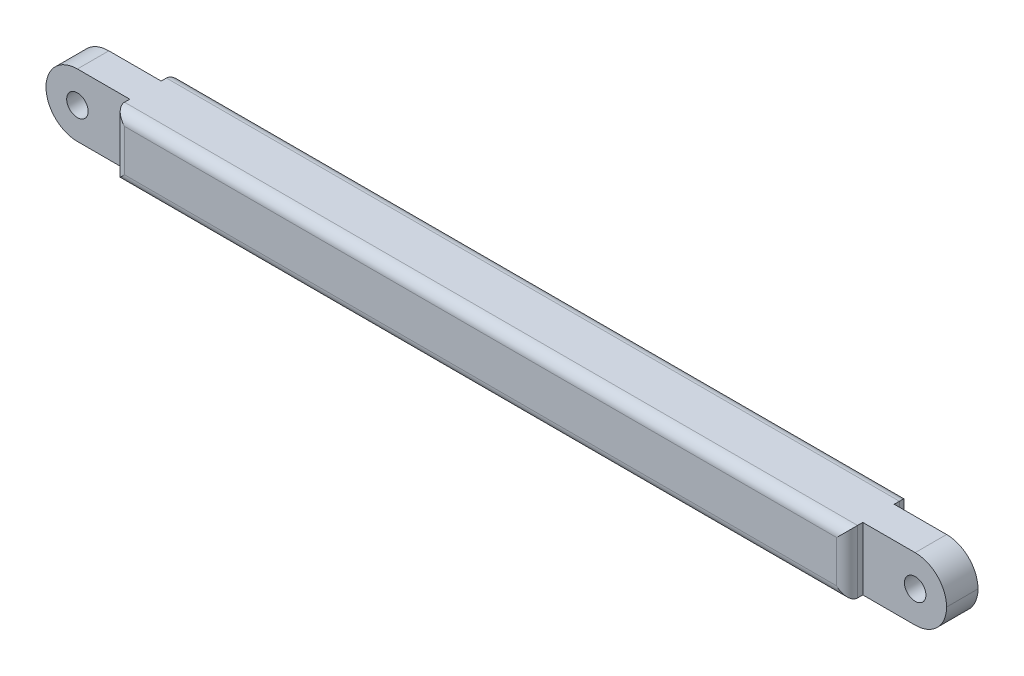
ISO-10303-21;
HEADER;
FILE_DESCRIPTION(('STEP AP214'),'2;1');
FILE_NAME('part.step','',(''),(''),'','','');
FILE_SCHEMA(('AUTOMOTIVE_DESIGN { 1 0 10303 214 1 1 1 1 }'));
ENDSEC;
DATA;
#1=APPLICATION_CONTEXT('core data for automotive mechanical design processes');
#2=APPLICATION_PROTOCOL_DEFINITION('international standard','automotive_design',2000,#1);
#3=PRODUCT_CONTEXT('',#1,'mechanical');
#4=PRODUCT('Part','Part','',(#3));
#5=PRODUCT_RELATED_PRODUCT_CATEGORY('part','',(#4));
#6=PRODUCT_DEFINITION_FORMATION('','',#4);
#7=PRODUCT_DEFINITION_CONTEXT('part definition',#1,'design');
#8=PRODUCT_DEFINITION('design','',#6,#7);
#9=PRODUCT_DEFINITION_SHAPE('','',#8);
#10=(LENGTH_UNIT() NAMED_UNIT(*) SI_UNIT(.MILLI.,.METRE.));
#11=(NAMED_UNIT(*) PLANE_ANGLE_UNIT() SI_UNIT($,.RADIAN.));
#12=(NAMED_UNIT(*) SI_UNIT($,.STERADIAN.) SOLID_ANGLE_UNIT());
#13=UNCERTAINTY_MEASURE_WITH_UNIT(LENGTH_MEASURE(1.E-05),#10,'distance_accuracy_value','');
#14=(GEOMETRIC_REPRESENTATION_CONTEXT(3) GLOBAL_UNCERTAINTY_ASSIGNED_CONTEXT((#13)) GLOBAL_UNIT_ASSIGNED_CONTEXT((#10,
#11,#12)) REPRESENTATION_CONTEXT('',''));
#15=CARTESIAN_POINT('',(0.,0.,0.));
#16=DIRECTION('',(0.,0.,1.));
#17=DIRECTION('',(1.,0.,0.));
#18=AXIS2_PLACEMENT_3D('',#15,#16,#17);
#19=CARTESIAN_POINT('',(70.,6.,0.));
#20=DIRECTION('',(-1.,0.,0.));
#21=DIRECTION('',(0.,0.,1.));
#22=AXIS2_PLACEMENT_3D('',#19,#20,#21);
#23=PLANE('',#22);
#24=DIRECTION('',(0.,0.,-1.));
#25=VECTOR('',#24,1.);
#26=CARTESIAN_POINT('',(70.,6.,0.));
#27=LINE('',#26,#25);
#28=CARTESIAN_POINT('',(70.,6.,-1.));
#29=VERTEX_POINT('',#28);
#30=CARTESIAN_POINT('',(70.,6.,-1.5));
#31=VERTEX_POINT('',#30);
#32=EDGE_CURVE('E194',#29,#31,#27,.T.);
#33=ORIENTED_EDGE('',*,*,#32,.F.);
#34=DIRECTION('',(0.,-1.,0.));
#35=VECTOR('',#34,1.);
#36=CARTESIAN_POINT('',(70.,6.,-1.));
#37=LINE('',#36,#35);
#38=CARTESIAN_POINT('',(70.,0.,-1.));
#39=VERTEX_POINT('',#38);
#40=EDGE_CURVE('E291',#29,#39,#37,.T.);
#41=ORIENTED_EDGE('',*,*,#40,.T.);
#42=DIRECTION('',(0.,0.,-1.));
#43=VECTOR('',#42,1.);
#44=CARTESIAN_POINT('',(70.,0.,0.));
#45=LINE('',#44,#43);
#46=CARTESIAN_POINT('',(70.,0.,-1.5));
#47=VERTEX_POINT('',#46);
#48=EDGE_CURVE('E248',#39,#47,#45,.T.);
#49=ORIENTED_EDGE('',*,*,#48,.T.);
#50=DIRECTION('',(0.,-1.,0.));
#51=VECTOR('',#50,1.);
#52=CARTESIAN_POINT('',(70.,6.,-1.5));
#53=LINE('',#52,#51);
#54=EDGE_CURVE('E200',#31,#47,#53,.T.);
#55=ORIENTED_EDGE('',*,*,#54,.F.);
#56=EDGE_LOOP('',(#33,#41,#49,#55));
#57=FACE_BOUND('',#56,.T.);
#58=ADVANCED_FACE('F45',(#57),#23,.F.);
#59=CARTESIAN_POINT('',(70.,0.,-4.5));
#60=VERTEX_POINT('',#59);
#61=CARTESIAN_POINT('',(70.,0.,-5.));
#62=VERTEX_POINT('',#61);
#63=EDGE_CURVE('E247',#60,#62,#45,.T.);
#64=ORIENTED_EDGE('',*,*,#63,.T.);
#65=DIRECTION('',(0.,-1.,0.));
#66=VECTOR('',#65,1.);
#67=CARTESIAN_POINT('',(70.,6.,-5.));
#68=LINE('',#67,#66);
#69=CARTESIAN_POINT('',(70.,6.,-5.));
#70=VERTEX_POINT('',#69);
#71=EDGE_CURVE('E192',#62,#70,#68,.F.);
#72=ORIENTED_EDGE('',*,*,#71,.T.);
#73=CARTESIAN_POINT('',(70.,6.,-4.5));
#74=VERTEX_POINT('',#73);
#75=EDGE_CURVE('E175',#74,#70,#27,.T.);
#76=ORIENTED_EDGE('',*,*,#75,.F.);
#77=DIRECTION('',(0.,1.,0.));
#78=VECTOR('',#77,1.);
#79=CARTESIAN_POINT('',(70.,6.,-4.5));
#80=LINE('',#79,#78);
#81=EDGE_CURVE('E189',#60,#74,#80,.T.);
#82=ORIENTED_EDGE('',*,*,#81,.F.);
#83=EDGE_LOOP('',(#64,#72,#76,#82));
#84=FACE_BOUND('',#83,.T.);
#85=ADVANCED_FACE('F188',(#84),#23,.F.);
#86=CARTESIAN_POINT('',(0.,6.,0.));
#87=DIRECTION('',(1.,0.,0.));
#88=DIRECTION('',(0.,0.,-1.));
#89=AXIS2_PLACEMENT_3D('',#86,#87,#88);
#90=PLANE('',#89);
#91=DIRECTION('',(0.,0.,1.));
#92=VECTOR('',#91,1.);
#93=CARTESIAN_POINT('',(0.,6.,0.));
#94=LINE('',#93,#92);
#95=CARTESIAN_POINT('',(0.,6.,-5.));
#96=VERTEX_POINT('',#95);
#97=CARTESIAN_POINT('',(0.,6.,-4.5));
#98=VERTEX_POINT('',#97);
#99=EDGE_CURVE('E195',#96,#98,#94,.T.);
#100=ORIENTED_EDGE('',*,*,#99,.F.);
#101=DIRECTION('',(0.,-1.,0.));
#102=VECTOR('',#101,1.);
#103=CARTESIAN_POINT('',(0.,6.,-5.));
#104=LINE('',#103,#102);
#105=CARTESIAN_POINT('',(0.,0.,-5.));
#106=VERTEX_POINT('',#105);
#107=EDGE_CURVE('E274',#96,#106,#104,.T.);
#108=ORIENTED_EDGE('',*,*,#107,.T.);
#109=DIRECTION('',(0.,0.,1.));
#110=VECTOR('',#109,1.);
#111=CARTESIAN_POINT('',(0.,0.,0.));
#112=LINE('',#111,#110);
#113=CARTESIAN_POINT('',(0.,0.,-4.5));
#114=VERTEX_POINT('',#113);
#115=EDGE_CURVE('E243',#106,#114,#112,.T.);
#116=ORIENTED_EDGE('',*,*,#115,.T.);
#117=DIRECTION('',(0.,-1.,0.));
#118=VECTOR('',#117,1.);
#119=CARTESIAN_POINT('',(0.,6.,-4.5));
#120=LINE('',#119,#118);
#121=EDGE_CURVE('E215',#98,#114,#120,.T.);
#122=ORIENTED_EDGE('',*,*,#121,.F.);
#123=EDGE_LOOP('',(#100,#108,#116,#122));
#124=FACE_BOUND('',#123,.T.);
#125=ADVANCED_FACE('F440',(#124),#90,.F.);
#126=CARTESIAN_POINT('',(0.,0.,-1.5));
#127=VERTEX_POINT('',#126);
#128=CARTESIAN_POINT('',(0.,0.,-1.));
#129=VERTEX_POINT('',#128);
#130=EDGE_CURVE('E235',#127,#129,#112,.T.);
#131=ORIENTED_EDGE('',*,*,#130,.T.);
#132=DIRECTION('',(0.,-1.,0.));
#133=VECTOR('',#132,1.);
#134=CARTESIAN_POINT('',(0.,6.,-1.));
#135=LINE('',#134,#133);
#136=CARTESIAN_POINT('',(0.,6.,-1.));
#137=VERTEX_POINT('',#136);
#138=EDGE_CURVE('E270',#129,#137,#135,.F.);
#139=ORIENTED_EDGE('',*,*,#138,.T.);
#140=CARTESIAN_POINT('',(0.,6.,-1.5));
#141=VERTEX_POINT('',#140);
#142=EDGE_CURVE('E238',#141,#137,#94,.T.);
#143=ORIENTED_EDGE('',*,*,#142,.F.);
#144=DIRECTION('',(0.,1.,0.));
#145=VECTOR('',#144,1.);
#146=CARTESIAN_POINT('',(0.,6.,-1.5));
#147=LINE('',#146,#145);
#148=EDGE_CURVE('E219',#127,#141,#147,.T.);
#149=ORIENTED_EDGE('',*,*,#148,.F.);
#150=EDGE_LOOP('',(#131,#139,#143,#149));
#151=FACE_BOUND('',#150,.T.);
#152=ADVANCED_FACE('F402',(#151),#90,.F.);
#153=CARTESIAN_POINT('',(0.,6.,0.));
#154=DIRECTION('',(0.,0.,-1.));
#155=DIRECTION('',(-1.,0.,0.));
#156=AXIS2_PLACEMENT_3D('',#153,#154,#155);
#157=PLANE('',#156);
#158=DIRECTION('',(0.,-1.,0.));
#159=VECTOR('',#158,1.);
#160=CARTESIAN_POINT('',(1.,6.,0.));
#161=LINE('',#160,#159);
#162=CARTESIAN_POINT('',(1.,5.,0.));
#163=VERTEX_POINT('',#162);
#164=CARTESIAN_POINT('',(1.,1.,0.));
#165=VERTEX_POINT('',#164);
#166=EDGE_CURVE('E263',#163,#165,#161,.T.);
#167=ORIENTED_EDGE('',*,*,#166,.T.);
#168=DIRECTION('',(1.,0.,0.));
#169=VECTOR('',#168,1.);
#170=CARTESIAN_POINT('',(70.,1.,0.));
#171=LINE('',#170,#169);
#172=CARTESIAN_POINT('',(69.,1.,0.));
#173=VERTEX_POINT('',#172);
#174=EDGE_CURVE('E267',#165,#173,#171,.T.);
#175=ORIENTED_EDGE('',*,*,#174,.T.);
#176=DIRECTION('',(0.,-1.,0.));
#177=VECTOR('',#176,1.);
#178=CARTESIAN_POINT('',(69.,6.,0.));
#179=LINE('',#178,#177);
#180=CARTESIAN_POINT('',(69.,5.,0.));
#181=VERTEX_POINT('',#180);
#182=EDGE_CURVE('E260',#173,#181,#179,.F.);
#183=ORIENTED_EDGE('',*,*,#182,.T.);
#184=DIRECTION('',(1.,0.,0.));
#185=VECTOR('',#184,1.);
#186=CARTESIAN_POINT('',(0.,5.,0.));
#187=LINE('',#186,#185);
#188=EDGE_CURVE('E242',#181,#163,#187,.F.);
#189=ORIENTED_EDGE('',*,*,#188,.T.);
#190=EDGE_LOOP('',(#167,#175,#183,#189));
#191=FACE_BOUND('',#190,.T.);
#192=ADVANCED_FACE('F415',(#191),#157,.F.);
#193=CARTESIAN_POINT('',(0.,6.,-6.));
#194=DIRECTION('',(0.,0.,1.));
#195=DIRECTION('',(1.,0.,0.));
#196=AXIS2_PLACEMENT_3D('',#193,#194,#195);
#197=PLANE('',#196);
#198=DIRECTION('',(0.,-1.,0.));
#199=VECTOR('',#198,1.);
#200=CARTESIAN_POINT('',(69.,6.,-6.));
#201=LINE('',#200,#199);
#202=CARTESIAN_POINT('',(69.,5.,-6.));
#203=VERTEX_POINT('',#202);
#204=CARTESIAN_POINT('',(69.,1.,-6.));
#205=VERTEX_POINT('',#204);
#206=EDGE_CURVE('E281',#203,#205,#201,.T.);
#207=ORIENTED_EDGE('',*,*,#206,.T.);
#208=DIRECTION('',(-1.,0.,0.));
#209=VECTOR('',#208,1.);
#210=CARTESIAN_POINT('',(0.,1.,-6.));
#211=LINE('',#210,#209);
#212=CARTESIAN_POINT('',(1.,1.,-6.));
#213=VERTEX_POINT('',#212);
#214=EDGE_CURVE('E288',#205,#213,#211,.T.);
#215=ORIENTED_EDGE('',*,*,#214,.T.);
#216=DIRECTION('',(0.,-1.,0.));
#217=VECTOR('',#216,1.);
#218=CARTESIAN_POINT('',(1.,6.,-6.));
#219=LINE('',#218,#217);
#220=CARTESIAN_POINT('',(1.,5.,-6.));
#221=VERTEX_POINT('',#220);
#222=EDGE_CURVE('E284',#213,#221,#219,.F.);
#223=ORIENTED_EDGE('',*,*,#222,.T.);
#224=DIRECTION('',(-1.,0.,0.));
#225=VECTOR('',#224,1.);
#226=CARTESIAN_POINT('',(0.,5.,-6.));
#227=LINE('',#226,#225);
#228=EDGE_CURVE('E278',#221,#203,#227,.F.);
#229=ORIENTED_EDGE('',*,*,#228,.T.);
#230=EDGE_LOOP('',(#207,#215,#223,#229));
#231=FACE_BOUND('',#230,.T.);
#232=ADVANCED_FACE('F443',(#231),#197,.F.);
#233=CARTESIAN_POINT('',(0.,6.,0.));
#234=DIRECTION('',(0.,-1.,0.));
#235=DIRECTION('',(0.,0.,-1.));
#236=AXIS2_PLACEMENT_3D('',#233,#234,#235);
#237=PLANE('',#236);
#238=DIRECTION('',(1.,0.,0.));
#239=VECTOR('',#238,1.);
#240=CARTESIAN_POINT('',(-8.,6.,-4.5));
#241=LINE('',#240,#239);
#242=CARTESIAN_POINT('',(-5.,6.,-4.5));
#243=VERTEX_POINT('',#242);
#244=EDGE_CURVE('E223',#243,#98,#241,.T.);
#245=ORIENTED_EDGE('',*,*,#244,.F.);
#246=DIRECTION('',(0.,0.,-1.));
#247=VECTOR('',#246,1.);
#248=CARTESIAN_POINT('',(-5.,6.,-1.5));
#249=LINE('',#248,#247);
#250=CARTESIAN_POINT('',(-5.,6.,-1.5));
#251=VERTEX_POINT('',#250);
#252=EDGE_CURVE('E359',#243,#251,#249,.F.);
#253=ORIENTED_EDGE('',*,*,#252,.T.);
#254=DIRECTION('',(1.,0.,0.));
#255=VECTOR('',#254,1.);
#256=CARTESIAN_POINT('',(-8.,6.,-1.5));
#257=LINE('',#256,#255);
#258=EDGE_CURVE('E226',#251,#141,#257,.T.);
#259=ORIENTED_EDGE('',*,*,#258,.T.);
#260=ORIENTED_EDGE('',*,*,#142,.T.);
#261=DIRECTION('',(1.,0.,0.));
#262=VECTOR('',#261,1.);
#263=CARTESIAN_POINT('',(0.,6.,-1.));
#264=LINE('',#263,#262);
#265=EDGE_CURVE('E302',#137,#29,#264,.T.);
#266=ORIENTED_EDGE('',*,*,#265,.T.);
#267=ORIENTED_EDGE('',*,*,#32,.T.);
#268=DIRECTION('',(-1.,0.,0.));
#269=VECTOR('',#268,1.);
#270=CARTESIAN_POINT('',(78.,6.,-1.5));
#271=LINE('',#270,#269);
#272=CARTESIAN_POINT('',(75.,6.,-1.5));
#273=VERTEX_POINT('',#272);
#274=EDGE_CURVE('E183',#273,#31,#271,.T.);
#275=ORIENTED_EDGE('',*,*,#274,.F.);
#276=DIRECTION('',(0.,0.,1.));
#277=VECTOR('',#276,1.);
#278=CARTESIAN_POINT('',(75.,6.,-4.5));
#279=LINE('',#278,#277);
#280=CARTESIAN_POINT('',(75.,6.,-4.5));
#281=VERTEX_POINT('',#280);
#282=EDGE_CURVE('E179',#273,#281,#279,.F.);
#283=ORIENTED_EDGE('',*,*,#282,.T.);
#284=DIRECTION('',(-1.,0.,0.));
#285=VECTOR('',#284,1.);
#286=CARTESIAN_POINT('',(78.,6.,-4.5));
#287=LINE('',#286,#285);
#288=EDGE_CURVE('E171',#281,#74,#287,.T.);
#289=ORIENTED_EDGE('',*,*,#288,.T.);
#290=ORIENTED_EDGE('',*,*,#75,.T.);
#291=DIRECTION('',(-1.,0.,0.));
#292=VECTOR('',#291,1.);
#293=CARTESIAN_POINT('',(0.,6.,-5.));
#294=LINE('',#293,#292);
#295=EDGE_CURVE('E305',#70,#96,#294,.T.);
#296=ORIENTED_EDGE('',*,*,#295,.T.);
#297=ORIENTED_EDGE('',*,*,#99,.T.);
#298=EDGE_LOOP('',(#245,#253,#259,#260,#266,#267,#275,#283,#289,#290,#296,#297));
#299=FACE_BOUND('',#298,.T.);
#300=ADVANCED_FACE('F174',(#299),#237,.F.);
#301=CARTESIAN_POINT('',(0.,0.,0.));
#302=DIRECTION('',(0.,-1.,0.));
#303=DIRECTION('',(0.,0.,-1.));
#304=AXIS2_PLACEMENT_3D('',#301,#302,#303);
#305=PLANE('',#304);
#306=DIRECTION('',(1.,0.,0.));
#307=VECTOR('',#306,1.);
#308=CARTESIAN_POINT('',(-8.,0.,-1.5));
#309=LINE('',#308,#307);
#310=CARTESIAN_POINT('',(-5.,0.,-1.5));
#311=VERTEX_POINT('',#310);
#312=EDGE_CURVE('E229',#311,#127,#309,.T.);
#313=ORIENTED_EDGE('',*,*,#312,.F.);
#314=DIRECTION('',(0.,0.,1.));
#315=VECTOR('',#314,1.);
#316=CARTESIAN_POINT('',(-5.,0.,0.));
#317=LINE('',#316,#315);
#318=CARTESIAN_POINT('',(-5.,0.,-4.5));
#319=VERTEX_POINT('',#318);
#320=EDGE_CURVE('E347',#311,#319,#317,.F.);
#321=ORIENTED_EDGE('',*,*,#320,.T.);
#322=DIRECTION('',(1.,0.,0.));
#323=VECTOR('',#322,1.);
#324=CARTESIAN_POINT('',(-8.,0.,-4.5));
#325=LINE('',#324,#323);
#326=EDGE_CURVE('E232',#319,#114,#325,.T.);
#327=ORIENTED_EDGE('',*,*,#326,.T.);
#328=ORIENTED_EDGE('',*,*,#115,.F.);
#329=DIRECTION('',(-1.,0.,0.));
#330=VECTOR('',#329,1.);
#331=CARTESIAN_POINT('',(70.,0.,-5.));
#332=LINE('',#331,#330);
#333=EDGE_CURVE('E299',#106,#62,#332,.F.);
#334=ORIENTED_EDGE('',*,*,#333,.T.);
#335=ORIENTED_EDGE('',*,*,#63,.F.);
#336=DIRECTION('',(-1.,0.,0.));
#337=VECTOR('',#336,1.);
#338=CARTESIAN_POINT('',(78.,0.,-4.5));
#339=LINE('',#338,#337);
#340=CARTESIAN_POINT('',(75.,0.,-4.5));
#341=VERTEX_POINT('',#340);
#342=EDGE_CURVE('E182',#341,#60,#339,.T.);
#343=ORIENTED_EDGE('',*,*,#342,.F.);
#344=DIRECTION('',(0.,0.,-1.));
#345=VECTOR('',#344,1.);
#346=CARTESIAN_POINT('',(75.,0.,0.));
#347=LINE('',#346,#345);
#348=CARTESIAN_POINT('',(75.,0.,-1.5));
#349=VERTEX_POINT('',#348);
#350=EDGE_CURVE('E343',#341,#349,#347,.F.);
#351=ORIENTED_EDGE('',*,*,#350,.T.);
#352=DIRECTION('',(-1.,0.,0.));
#353=VECTOR('',#352,1.);
#354=CARTESIAN_POINT('',(78.,0.,-1.5));
#355=LINE('',#354,#353);
#356=EDGE_CURVE('E212',#349,#47,#355,.T.);
#357=ORIENTED_EDGE('',*,*,#356,.T.);
#358=ORIENTED_EDGE('',*,*,#48,.F.);
#359=DIRECTION('',(1.,0.,0.));
#360=VECTOR('',#359,1.);
#361=CARTESIAN_POINT('',(0.,0.,-1.));
#362=LINE('',#361,#360);
#363=EDGE_CURVE('E296',#39,#129,#362,.F.);
#364=ORIENTED_EDGE('',*,*,#363,.T.);
#365=ORIENTED_EDGE('',*,*,#130,.F.);
#366=EDGE_LOOP('',(#313,#321,#327,#328,#334,#335,#343,#351,#357,#358,#364,#365));
#367=FACE_BOUND('',#366,.T.);
#368=ADVANCED_FACE('F390',(#367),#305,.T.);
#369=CARTESIAN_POINT('',(-8.,6.,-4.5));
#370=DIRECTION('',(0.,0.,1.));
#371=DIRECTION('',(1.,0.,0.));
#372=AXIS2_PLACEMENT_3D('',#369,#370,#371);
#373=PLANE('',#372);
#374=CARTESIAN_POINT('',(-5.,3.,-4.5));
#375=DIRECTION('',(0.,0.,1.));
#376=DIRECTION('',(1.,0.,0.));
#377=AXIS2_PLACEMENT_3D('',#374,#375,#376);
#378=CIRCLE('',#377,1.025);
#379=CARTESIAN_POINT('',(-3.975,3.,-4.5));
#380=VERTEX_POINT('',#379);
#381=EDGE_CURVE('E206',#380,#380,#378,.T.);
#382=ORIENTED_EDGE('',*,*,#381,.T.);
#383=EDGE_LOOP('',(#382));
#384=FACE_BOUND('',#383,.T.);
#385=ORIENTED_EDGE('',*,*,#326,.F.);
#386=CARTESIAN_POINT('',(-5.,3.,-4.5));
#387=DIRECTION('',(0.,0.,1.));
#388=DIRECTION('',(1.,0.,0.));
#389=AXIS2_PLACEMENT_3D('',#386,#387,#388);
#390=CIRCLE('',#389,3.);
#391=CARTESIAN_POINT('',(-8.,3.,-4.5));
#392=VERTEX_POINT('',#391);
#393=EDGE_CURVE('E354',#319,#392,#390,.F.);
#394=ORIENTED_EDGE('',*,*,#393,.T.);
#395=CARTESIAN_POINT('',(-5.,3.,-4.5));
#396=DIRECTION('',(0.,0.,1.));
#397=DIRECTION('',(1.,0.,0.));
#398=AXIS2_PLACEMENT_3D('',#395,#396,#397);
#399=CIRCLE('',#398,3.);
#400=EDGE_CURVE('E351',#392,#243,#399,.F.);
#401=ORIENTED_EDGE('',*,*,#400,.T.);
#402=ORIENTED_EDGE('',*,*,#244,.T.);
#403=ORIENTED_EDGE('',*,*,#121,.T.);
#404=EDGE_LOOP('',(#385,#394,#401,#402,#403));
#405=FACE_BOUND('',#404,.T.);
#406=ADVANCED_FACE('F514',(#384,#405),#373,.F.);
#407=CARTESIAN_POINT('',(-8.,6.,-1.5));
#408=DIRECTION('',(0.,0.,-1.));
#409=DIRECTION('',(0.,1.,0.));
#410=AXIS2_PLACEMENT_3D('',#407,#408,#409);
#411=PLANE('',#410);
#412=CARTESIAN_POINT('',(-5.,3.,-1.5));
#413=DIRECTION('',(0.,0.,1.));
#414=DIRECTION('',(1.,0.,0.));
#415=AXIS2_PLACEMENT_3D('',#412,#413,#414);
#416=CIRCLE('',#415,1.025);
#417=CARTESIAN_POINT('',(-3.975,3.,-1.5));
#418=VERTEX_POINT('',#417);
#419=EDGE_CURVE('E256',#418,#418,#416,.T.);
#420=ORIENTED_EDGE('',*,*,#419,.F.);
#421=EDGE_LOOP('',(#420));
#422=FACE_BOUND('',#421,.T.);
#423=CARTESIAN_POINT('',(-5.,3.,-1.5));
#424=DIRECTION('',(0.,0.,-1.));
#425=DIRECTION('',(0.,1.,0.));
#426=AXIS2_PLACEMENT_3D('',#423,#424,#425);
#427=CIRCLE('',#426,3.);
#428=CARTESIAN_POINT('',(-8.,3.,-1.5));
#429=VERTEX_POINT('',#428);
#430=EDGE_CURVE('E308',#251,#429,#427,.F.);
#431=ORIENTED_EDGE('',*,*,#430,.T.);
#432=CARTESIAN_POINT('',(-5.,3.,-1.5));
#433=DIRECTION('',(0.,0.,-1.));
#434=DIRECTION('',(0.,1.,0.));
#435=AXIS2_PLACEMENT_3D('',#432,#433,#434);
#436=CIRCLE('',#435,3.);
#437=EDGE_CURVE('E340',#429,#311,#436,.F.);
#438=ORIENTED_EDGE('',*,*,#437,.T.);
#439=ORIENTED_EDGE('',*,*,#312,.T.);
#440=ORIENTED_EDGE('',*,*,#148,.T.);
#441=ORIENTED_EDGE('',*,*,#258,.F.);
#442=EDGE_LOOP('',(#431,#438,#439,#440,#441));
#443=FACE_BOUND('',#442,.T.);
#444=ADVANCED_FACE('F522',(#422,#443),#411,.F.);
#445=CARTESIAN_POINT('',(78.,6.,-1.5));
#446=DIRECTION('',(0.,0.,-1.));
#447=DIRECTION('',(-1.,0.,0.));
#448=AXIS2_PLACEMENT_3D('',#445,#446,#447);
#449=PLANE('',#448);
#450=CARTESIAN_POINT('',(75.,3.,-1.5));
#451=DIRECTION('',(0.,0.,1.));
#452=DIRECTION('',(1.,0.,0.));
#453=AXIS2_PLACEMENT_3D('',#450,#451,#452);
#454=CIRCLE('',#453,1.025);
#455=CARTESIAN_POINT('',(76.025,3.,-1.5));
#456=VERTEX_POINT('',#455);
#457=EDGE_CURVE('E257',#456,#456,#454,.T.);
#458=ORIENTED_EDGE('',*,*,#457,.F.);
#459=EDGE_LOOP('',(#458));
#460=FACE_BOUND('',#459,.T.);
#461=ORIENTED_EDGE('',*,*,#356,.F.);
#462=CARTESIAN_POINT('',(75.,3.,-1.5));
#463=DIRECTION('',(0.,0.,-1.));
#464=DIRECTION('',(-1.,0.,0.));
#465=AXIS2_PLACEMENT_3D('',#462,#463,#464);
#466=CIRCLE('',#465,3.);
#467=CARTESIAN_POINT('',(78.,3.,-1.5));
#468=VERTEX_POINT('',#467);
#469=EDGE_CURVE('E11',#349,#468,#466,.F.);
#470=ORIENTED_EDGE('',*,*,#469,.T.);
#471=CARTESIAN_POINT('',(75.,3.,-1.5));
#472=DIRECTION('',(0.,0.,-1.));
#473=DIRECTION('',(-1.,0.,0.));
#474=AXIS2_PLACEMENT_3D('',#471,#472,#473);
#475=CIRCLE('',#474,3.);
#476=EDGE_CURVE('E55',#468,#273,#475,.F.);
#477=ORIENTED_EDGE('',*,*,#476,.T.);
#478=ORIENTED_EDGE('',*,*,#274,.T.);
#479=ORIENTED_EDGE('',*,*,#54,.T.);
#480=EDGE_LOOP('',(#461,#470,#477,#478,#479));
#481=FACE_BOUND('',#480,.T.);
#482=ADVANCED_FACE('F380',(#460,#481),#449,.F.);
#483=CARTESIAN_POINT('',(78.,6.,-4.5));
#484=DIRECTION('',(0.,0.,1.));
#485=DIRECTION('',(0.,-1.,0.));
#486=AXIS2_PLACEMENT_3D('',#483,#484,#485);
#487=PLANE('',#486);
#488=CARTESIAN_POINT('',(75.,3.,-4.5));
#489=DIRECTION('',(0.,0.,1.));
#490=DIRECTION('',(0.,-1.,0.));
#491=AXIS2_PLACEMENT_3D('',#488,#489,#490);
#492=CIRCLE('',#491,1.025);
#493=CARTESIAN_POINT('',(75.,1.975,-4.5));
#494=VERTEX_POINT('',#493);
#495=EDGE_CURVE('E252',#494,#494,#492,.T.);
#496=ORIENTED_EDGE('',*,*,#495,.T.);
#497=EDGE_LOOP('',(#496));
#498=FACE_BOUND('',#497,.T.);
#499=CARTESIAN_POINT('',(75.,3.,-4.5));
#500=DIRECTION('',(0.,0.,1.));
#501=DIRECTION('',(0.,-1.,0.));
#502=AXIS2_PLACEMENT_3D('',#499,#500,#501);
#503=CIRCLE('',#502,3.);
#504=CARTESIAN_POINT('',(78.,3.,-4.5));
#505=VERTEX_POINT('',#504);
#506=EDGE_CURVE('E69',#281,#505,#503,.F.);
#507=ORIENTED_EDGE('',*,*,#506,.T.);
#508=CARTESIAN_POINT('',(75.,3.,-4.5));
#509=DIRECTION('',(0.,0.,1.));
#510=DIRECTION('',(0.,-1.,0.));
#511=AXIS2_PLACEMENT_3D('',#508,#509,#510);
#512=CIRCLE('',#511,3.);
#513=EDGE_CURVE('E364',#505,#341,#512,.F.);
#514=ORIENTED_EDGE('',*,*,#513,.T.);
#515=ORIENTED_EDGE('',*,*,#342,.T.);
#516=ORIENTED_EDGE('',*,*,#81,.T.);
#517=ORIENTED_EDGE('',*,*,#288,.F.);
#518=EDGE_LOOP('',(#507,#514,#515,#516,#517));
#519=FACE_BOUND('',#518,.T.);
#520=ADVANCED_FACE('F197',(#498,#519),#487,.F.);
#521=CARTESIAN_POINT('',(-5.,3.,-9.5));
#522=DIRECTION('',(0.,0.,1.));
#523=DIRECTION('',(1.,0.,0.));
#524=AXIS2_PLACEMENT_3D('',#521,#522,#523);
#525=CYLINDRICAL_SURFACE('',#524,1.025);
#526=ORIENTED_EDGE('',*,*,#419,.T.);
#527=EDGE_LOOP('',(#526));
#528=FACE_BOUND('',#527,.T.);
#529=ORIENTED_EDGE('',*,*,#381,.F.);
#530=EDGE_LOOP('',(#529));
#531=FACE_BOUND('',#530,.T.);
#532=ADVANCED_FACE('F431',(#528,#531),#525,.F.);
#533=CARTESIAN_POINT('',(75.,3.,-9.5));
#534=DIRECTION('',(0.,0.,1.));
#535=DIRECTION('',(1.,0.,0.));
#536=AXIS2_PLACEMENT_3D('',#533,#534,#535);
#537=CYLINDRICAL_SURFACE('',#536,1.025);
#538=ORIENTED_EDGE('',*,*,#457,.T.);
#539=EDGE_LOOP('',(#538));
#540=FACE_BOUND('',#539,.T.);
#541=ORIENTED_EDGE('',*,*,#495,.F.);
#542=EDGE_LOOP('',(#541));
#543=FACE_BOUND('',#542,.T.);
#544=ADVANCED_FACE('F423',(#540,#543),#537,.F.);
#545=CARTESIAN_POINT('',(69.,6.,-1.));
#546=DIRECTION('',(0.,-1.,0.));
#547=DIRECTION('',(0.,0.,-1.));
#548=AXIS2_PLACEMENT_3D('',#545,#546,#547);
#549=CYLINDRICAL_SURFACE('',#548,1.);
#550=CARTESIAN_POINT('',(69.,1.,-1.));
#551=DIRECTION('',(-0.707106781186547,-0.707106781186547,0.));
#552=DIRECTION('',(-0.707106781186547,0.707106781186547,0.));
#553=AXIS2_PLACEMENT_3D('',#550,#551,#552);
#554=ELLIPSE('',#553,1.41421356237309,1.);
#555=EDGE_CURVE('E316',#39,#173,#554,.T.);
#556=ORIENTED_EDGE('',*,*,#555,.F.);
#557=ORIENTED_EDGE('',*,*,#40,.F.);
#558=CARTESIAN_POINT('',(69.,5.,-1.));
#559=DIRECTION('',(0.707106781186547,-0.707106781186547,0.));
#560=DIRECTION('',(0.707106781186547,0.707106781186547,0.));
#561=AXIS2_PLACEMENT_3D('',#558,#559,#560);
#562=ELLIPSE('',#561,1.41421356237309,1.);
#563=EDGE_CURVE('E320',#181,#29,#562,.F.);
#564=ORIENTED_EDGE('',*,*,#563,.F.);
#565=ORIENTED_EDGE('',*,*,#182,.F.);
#566=EDGE_LOOP('',(#556,#557,#564,#565));
#567=FACE_BOUND('',#566,.T.);
#568=ADVANCED_FACE('F421',(#567),#549,.T.);
#569=CARTESIAN_POINT('',(0.,5.,-1.));
#570=DIRECTION('',(1.,0.,0.));
#571=DIRECTION('',(0.,0.,-1.));
#572=AXIS2_PLACEMENT_3D('',#569,#570,#571);
#573=CYLINDRICAL_SURFACE('',#572,1.);
#574=ORIENTED_EDGE('',*,*,#563,.T.);
#575=ORIENTED_EDGE('',*,*,#265,.F.);
#576=CARTESIAN_POINT('',(1.,5.,-1.));
#577=DIRECTION('',(0.707106781186547,0.707106781186547,0.));
#578=DIRECTION('',(0.707106781186547,-0.707106781186547,0.));
#579=AXIS2_PLACEMENT_3D('',#576,#577,#578);
#580=ELLIPSE('',#579,1.41421356237309,1.);
#581=EDGE_CURVE('E312',#163,#137,#580,.F.);
#582=ORIENTED_EDGE('',*,*,#581,.F.);
#583=ORIENTED_EDGE('',*,*,#188,.F.);
#584=EDGE_LOOP('',(#574,#575,#582,#583));
#585=FACE_BOUND('',#584,.T.);
#586=ADVANCED_FACE('F419',(#585),#573,.T.);
#587=CARTESIAN_POINT('',(0.,1.,-1.));
#588=DIRECTION('',(-1.,0.,0.));
#589=DIRECTION('',(0.,0.,1.));
#590=AXIS2_PLACEMENT_3D('',#587,#588,#589);
#591=CYLINDRICAL_SURFACE('',#590,1.);
#592=ORIENTED_EDGE('',*,*,#555,.T.);
#593=ORIENTED_EDGE('',*,*,#174,.F.);
#594=CARTESIAN_POINT('',(1.,1.,-1.));
#595=DIRECTION('',(-0.707106781186547,0.707106781186547,0.));
#596=DIRECTION('',(-0.707106781186547,-0.707106781186547,0.));
#597=AXIS2_PLACEMENT_3D('',#594,#595,#596);
#598=ELLIPSE('',#597,1.41421356237309,1.);
#599=EDGE_CURVE('E309',#129,#165,#598,.T.);
#600=ORIENTED_EDGE('',*,*,#599,.F.);
#601=ORIENTED_EDGE('',*,*,#363,.F.);
#602=EDGE_LOOP('',(#592,#593,#600,#601));
#603=FACE_BOUND('',#602,.T.);
#604=ADVANCED_FACE('F412',(#603),#591,.T.);
#605=CARTESIAN_POINT('',(1.,6.,-1.));
#606=DIRECTION('',(0.,-1.,0.));
#607=DIRECTION('',(0.,0.,-1.));
#608=AXIS2_PLACEMENT_3D('',#605,#606,#607);
#609=CYLINDRICAL_SURFACE('',#608,1.);
#610=ORIENTED_EDGE('',*,*,#581,.T.);
#611=ORIENTED_EDGE('',*,*,#138,.F.);
#612=ORIENTED_EDGE('',*,*,#599,.T.);
#613=ORIENTED_EDGE('',*,*,#166,.F.);
#614=EDGE_LOOP('',(#610,#611,#612,#613));
#615=FACE_BOUND('',#614,.T.);
#616=ADVANCED_FACE('F406',(#615),#609,.T.);
#617=CARTESIAN_POINT('',(69.,6.,-5.));
#618=DIRECTION('',(0.,-1.,0.));
#619=DIRECTION('',(0.,0.,-1.));
#620=AXIS2_PLACEMENT_3D('',#617,#618,#619);
#621=CYLINDRICAL_SURFACE('',#620,1.);
#622=CARTESIAN_POINT('',(69.,1.,-5.));
#623=DIRECTION('',(0.707106781186547,0.707106781186547,0.));
#624=DIRECTION('',(0.707106781186547,-0.707106781186547,0.));
#625=AXIS2_PLACEMENT_3D('',#622,#623,#624);
#626=ELLIPSE('',#625,1.41421356237309,1.);
#627=EDGE_CURVE('E331',#205,#62,#626,.F.);
#628=ORIENTED_EDGE('',*,*,#627,.F.);
#629=ORIENTED_EDGE('',*,*,#206,.F.);
#630=CARTESIAN_POINT('',(69.,5.,-5.));
#631=DIRECTION('',(-0.707106781186547,0.707106781186547,0.));
#632=DIRECTION('',(-0.707106781186547,-0.707106781186547,0.));
#633=AXIS2_PLACEMENT_3D('',#630,#631,#632);
#634=ELLIPSE('',#633,1.41421356237309,1.);
#635=EDGE_CURVE('E313',#70,#203,#634,.T.);
#636=ORIENTED_EDGE('',*,*,#635,.F.);
#637=ORIENTED_EDGE('',*,*,#71,.F.);
#638=EDGE_LOOP('',(#628,#629,#636,#637));
#639=FACE_BOUND('',#638,.T.);
#640=ADVANCED_FACE('F452',(#639),#621,.T.);
#641=CARTESIAN_POINT('',(0.,5.,-5.));
#642=DIRECTION('',(-1.,0.,0.));
#643=DIRECTION('',(0.,0.,1.));
#644=AXIS2_PLACEMENT_3D('',#641,#642,#643);
#645=CYLINDRICAL_SURFACE('',#644,1.);
#646=ORIENTED_EDGE('',*,*,#635,.T.);
#647=ORIENTED_EDGE('',*,*,#228,.F.);
#648=CARTESIAN_POINT('',(1.,5.,-5.));
#649=DIRECTION('',(-0.707106781186547,-0.707106781186547,0.));
#650=DIRECTION('',(-0.707106781186547,0.707106781186547,0.));
#651=AXIS2_PLACEMENT_3D('',#648,#649,#650);
#652=ELLIPSE('',#651,1.41421356237309,1.);
#653=EDGE_CURVE('E327',#96,#221,#652,.T.);
#654=ORIENTED_EDGE('',*,*,#653,.F.);
#655=ORIENTED_EDGE('',*,*,#295,.F.);
#656=EDGE_LOOP('',(#646,#647,#654,#655));
#657=FACE_BOUND('',#656,.T.);
#658=ADVANCED_FACE('F470',(#657),#645,.T.);
#659=CARTESIAN_POINT('',(0.,1.,-5.));
#660=DIRECTION('',(1.,0.,0.));
#661=DIRECTION('',(0.,0.,-1.));
#662=AXIS2_PLACEMENT_3D('',#659,#660,#661);
#663=CYLINDRICAL_SURFACE('',#662,1.);
#664=ORIENTED_EDGE('',*,*,#627,.T.);
#665=ORIENTED_EDGE('',*,*,#333,.F.);
#666=CARTESIAN_POINT('',(1.,1.,-5.));
#667=DIRECTION('',(0.707106781186547,-0.707106781186547,0.));
#668=DIRECTION('',(0.707106781186547,0.707106781186547,0.));
#669=AXIS2_PLACEMENT_3D('',#666,#667,#668);
#670=ELLIPSE('',#669,1.41421356237309,1.);
#671=EDGE_CURVE('E324',#213,#106,#670,.F.);
#672=ORIENTED_EDGE('',*,*,#671,.F.);
#673=ORIENTED_EDGE('',*,*,#214,.F.);
#674=EDGE_LOOP('',(#664,#665,#672,#673));
#675=FACE_BOUND('',#674,.T.);
#676=ADVANCED_FACE('F479',(#675),#663,.T.);
#677=CARTESIAN_POINT('',(1.,6.,-5.));
#678=DIRECTION('',(0.,-1.,0.));
#679=DIRECTION('',(0.,0.,-1.));
#680=AXIS2_PLACEMENT_3D('',#677,#678,#679);
#681=CYLINDRICAL_SURFACE('',#680,1.);
#682=ORIENTED_EDGE('',*,*,#653,.T.);
#683=ORIENTED_EDGE('',*,*,#222,.F.);
#684=ORIENTED_EDGE('',*,*,#671,.T.);
#685=ORIENTED_EDGE('',*,*,#107,.F.);
#686=EDGE_LOOP('',(#682,#683,#684,#685));
#687=FACE_BOUND('',#686,.T.);
#688=ADVANCED_FACE('F488',(#687),#681,.T.);
#689=CARTESIAN_POINT('',(-5.,3.,0.));
#690=DIRECTION('',(0.,0.,1.));
#691=DIRECTION('',(1.,0.,0.));
#692=AXIS2_PLACEMENT_3D('',#689,#690,#691);
#693=CYLINDRICAL_SURFACE('',#692,3.);
#694=ORIENTED_EDGE('',*,*,#252,.F.);
#695=ORIENTED_EDGE('',*,*,#400,.F.);
#696=DIRECTION('',(0.,0.,-1.));
#697=VECTOR('',#696,1.);
#698=CARTESIAN_POINT('',(-8.,3.,-4.5));
#699=LINE('',#698,#697);
#700=EDGE_CURVE('E328',#429,#392,#699,.T.);
#701=ORIENTED_EDGE('',*,*,#700,.F.);
#702=ORIENTED_EDGE('',*,*,#430,.F.);
#703=EDGE_LOOP('',(#694,#695,#701,#702));
#704=FACE_BOUND('',#703,.T.);
#705=ADVANCED_FACE('F497',(#704),#693,.T.);
#706=CARTESIAN_POINT('',(-5.,3.,0.));
#707=DIRECTION('',(0.,0.,1.));
#708=DIRECTION('',(1.,0.,0.));
#709=AXIS2_PLACEMENT_3D('',#706,#707,#708);
#710=CYLINDRICAL_SURFACE('',#709,3.);
#711=ORIENTED_EDGE('',*,*,#393,.F.);
#712=ORIENTED_EDGE('',*,*,#320,.F.);
#713=ORIENTED_EDGE('',*,*,#437,.F.);
#714=ORIENTED_EDGE('',*,*,#700,.T.);
#715=EDGE_LOOP('',(#711,#712,#713,#714));
#716=FACE_BOUND('',#715,.T.);
#717=ADVANCED_FACE('F555',(#716),#710,.T.);
#718=CARTESIAN_POINT('',(75.,3.,0.));
#719=DIRECTION('',(0.,0.,-1.));
#720=DIRECTION('',(-1.,0.,0.));
#721=AXIS2_PLACEMENT_3D('',#718,#719,#720);
#722=CYLINDRICAL_SURFACE('',#721,3.);
#723=ORIENTED_EDGE('',*,*,#282,.F.);
#724=ORIENTED_EDGE('',*,*,#476,.F.);
#725=DIRECTION('',(0.,0.,1.));
#726=VECTOR('',#725,1.);
#727=CARTESIAN_POINT('',(78.,3.,-1.5));
#728=LINE('',#727,#726);
#729=EDGE_CURVE('E49',#505,#468,#728,.T.);
#730=ORIENTED_EDGE('',*,*,#729,.F.);
#731=ORIENTED_EDGE('',*,*,#506,.F.);
#732=EDGE_LOOP('',(#723,#724,#730,#731));
#733=FACE_BOUND('',#732,.T.);
#734=ADVANCED_FACE('F47',(#733),#722,.T.);
#735=CARTESIAN_POINT('',(75.,3.,0.));
#736=DIRECTION('',(0.,0.,-1.));
#737=DIRECTION('',(-1.,0.,0.));
#738=AXIS2_PLACEMENT_3D('',#735,#736,#737);
#739=CYLINDRICAL_SURFACE('',#738,3.);
#740=ORIENTED_EDGE('',*,*,#469,.F.);
#741=ORIENTED_EDGE('',*,*,#350,.F.);
#742=ORIENTED_EDGE('',*,*,#513,.F.);
#743=ORIENTED_EDGE('',*,*,#729,.T.);
#744=EDGE_LOOP('',(#740,#741,#742,#743));
#745=FACE_BOUND('',#744,.T.);
#746=ADVANCED_FACE('F377',(#745),#739,.T.);
#747=CLOSED_SHELL('',(#58,#85,#125,#152,#192,#232,#300,#368,#406,#444,#482,#520,#532,#544,#568,
#586,#604,#616,#640,#658,#676,#688,#705,#717,#734,#746));
#748=MANIFOLD_SOLID_BREP('B2',#747);
#749=ADVANCED_BREP_SHAPE_REPRESENTATION('',(#18,#748),#14);
#750=SHAPE_DEFINITION_REPRESENTATION(#9,#749);
ENDSEC;
END-ISO-10303-21;
